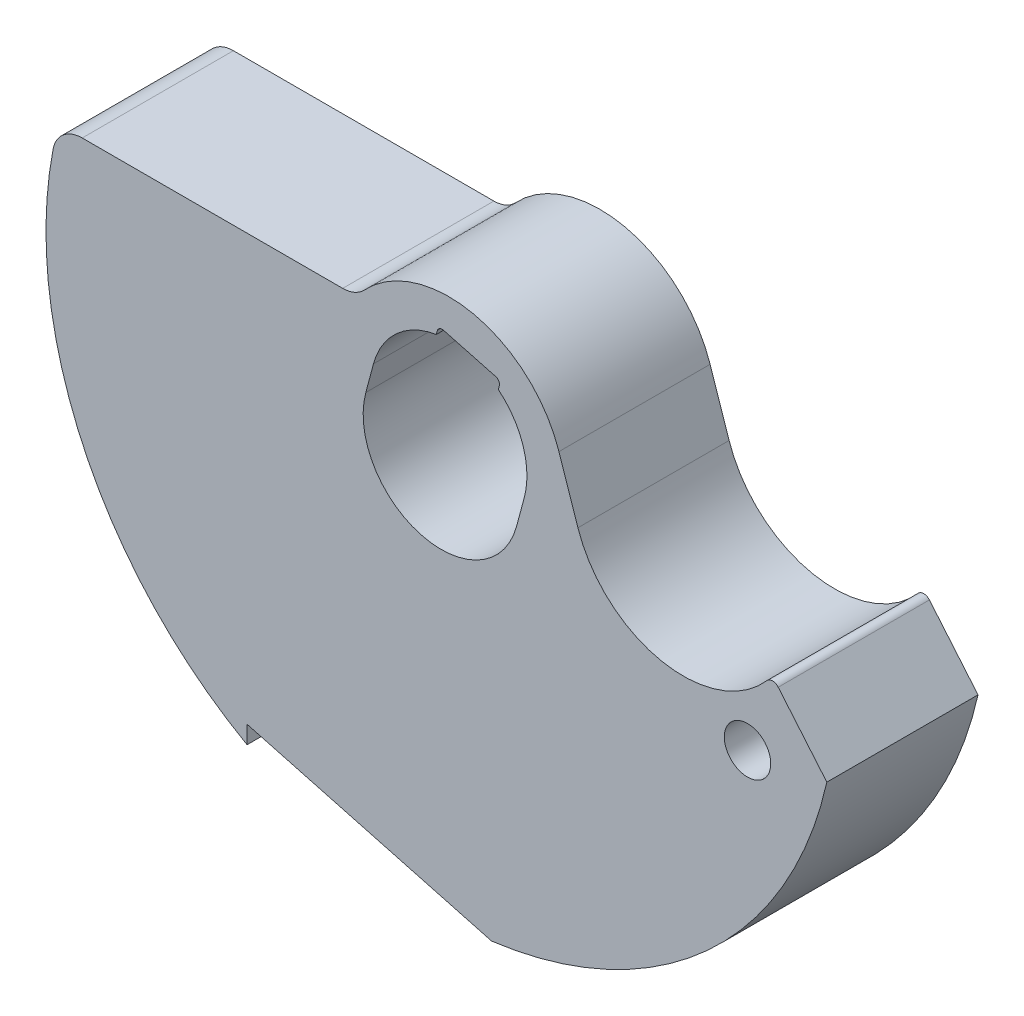
ISO-10303-21;
HEADER;
FILE_DESCRIPTION(('STEP AP214'),'2;1');
FILE_NAME('part.step','',(''),(''),'','','');
FILE_SCHEMA(('AUTOMOTIVE_DESIGN { 1 0 10303 214 1 1 1 1 }'));
ENDSEC;
DATA;
#1=APPLICATION_CONTEXT('core data for automotive mechanical design processes');
#2=APPLICATION_PROTOCOL_DEFINITION('international standard','automotive_design',2000,#1);
#3=PRODUCT_CONTEXT('',#1,'mechanical');
#4=PRODUCT('Part','Part','',(#3));
#5=PRODUCT_RELATED_PRODUCT_CATEGORY('part','',(#4));
#6=PRODUCT_DEFINITION_FORMATION('','',#4);
#7=PRODUCT_DEFINITION_CONTEXT('part definition',#1,'design');
#8=PRODUCT_DEFINITION('design','',#6,#7);
#9=PRODUCT_DEFINITION_SHAPE('','',#8);
#10=(LENGTH_UNIT() NAMED_UNIT(*) SI_UNIT(.MILLI.,.METRE.));
#11=(NAMED_UNIT(*) PLANE_ANGLE_UNIT() SI_UNIT($,.RADIAN.));
#12=(NAMED_UNIT(*) SI_UNIT($,.STERADIAN.) SOLID_ANGLE_UNIT());
#13=UNCERTAINTY_MEASURE_WITH_UNIT(LENGTH_MEASURE(1.E-05),#10,'distance_accuracy_value','');
#14=(GEOMETRIC_REPRESENTATION_CONTEXT(3) GLOBAL_UNCERTAINTY_ASSIGNED_CONTEXT((#13)) GLOBAL_UNIT_ASSIGNED_CONTEXT((#10,
#11,#12)) REPRESENTATION_CONTEXT('',''));
#15=CARTESIAN_POINT('',(0.,0.,0.));
#16=DIRECTION('',(0.,0.,1.));
#17=DIRECTION('',(1.,0.,0.));
#18=AXIS2_PLACEMENT_3D('',#15,#16,#17);
#19=CARTESIAN_POINT('',(-12.7084379808793,-41.0495620726679,-7.7724));
#20=DIRECTION('',(0.96592582628907,-0.258819045102514,0.));
#21=DIRECTION('',(0.258819045102514,0.96592582628907,0.));
#22=AXIS2_PLACEMENT_3D('',#19,#20,#21);
#23=PLANE('',#22);
#24=DIRECTION('',(0.258819045102514,0.96592582628907,0.));
#25=VECTOR('',#24,1.);
#26=CARTESIAN_POINT('',(-12.7084379808793,-41.0495620726679,0.));
#27=LINE('',#26,#25);
#28=CARTESIAN_POINT('',(-0.253578298371034,5.43260706359561,0.));
#29=VERTEX_POINT('',#28);
#30=CARTESIAN_POINT('',(-0.201054745135244,5.62862763286563,0.));
#31=VERTEX_POINT('',#30);
#32=EDGE_CURVE('E296',#29,#31,#27,.T.);
#33=ORIENTED_EDGE('',*,*,#32,.F.);
#34=DIRECTION('',(0.,0.,0.999999999999999));
#35=VECTOR('',#34,1.);
#36=CARTESIAN_POINT('',(-0.253578298371034,5.43260706359561,-7.7724));
#37=LINE('',#36,#35);
#38=CARTESIAN_POINT('',(-0.253578298371034,5.43260706359561,-7.7724));
#39=VERTEX_POINT('',#38);
#40=EDGE_CURVE('E12',#39,#29,#37,.T.);
#41=ORIENTED_EDGE('',*,*,#40,.F.);
#42=DIRECTION('',(0.258819045102514,0.96592582628907,0.));
#43=VECTOR('',#42,1.);
#44=CARTESIAN_POINT('',(-12.7084379808793,-41.0495620726679,-7.7724));
#45=LINE('',#44,#43);
#46=CARTESIAN_POINT('',(-0.201054745135244,5.62862763286563,-7.7724));
#47=VERTEX_POINT('',#46);
#48=EDGE_CURVE('E473',#39,#47,#45,.T.);
#49=ORIENTED_EDGE('',*,*,#48,.T.);
#50=DIRECTION('',(0.,0.,0.999999999999999));
#51=VECTOR('',#50,1.);
#52=CARTESIAN_POINT('',(-0.201054745135244,5.62862763286563,-7.7724));
#53=LINE('',#52,#51);
#54=EDGE_CURVE('E336',#47,#31,#53,.T.);
#55=ORIENTED_EDGE('',*,*,#54,.T.);
#56=EDGE_LOOP('',(#33,#41,#49,#55));
#57=FACE_BOUND('',#56,.T.);
#58=ADVANCED_FACE('F79',(#57),#23,.T.);
#59=CARTESIAN_POINT('',(0.394440224736232,1.47207095926455,-7.77239999999999));
#60=DIRECTION('',(0.,0.,0.999999999999999));
#61=DIRECTION('',(1.,0.,0.));
#62=AXIS2_PLACEMENT_3D('',#59,#60,#61);
#63=CYLINDRICAL_SURFACE('',#62,4.0132);
#64=CARTESIAN_POINT('',(0.394440224736232,1.47207095926454,0.));
#65=DIRECTION('',(0.,0.,0.999999999999999));
#66=DIRECTION('',(1.,0.,0.));
#67=AXIS2_PLACEMENT_3D('',#64,#65,#66);
#68=CIRCLE('',#67,4.0132);
#69=CARTESIAN_POINT('',(-3.48201330132707,2.51076355106995,0.));
#70=VERTEX_POINT('',#69);
#71=EDGE_CURVE('E320',#29,#70,#68,.T.);
#72=ORIENTED_EDGE('',*,*,#71,.T.);
#73=DIRECTION('',(0.,0.,0.999999999999999));
#74=VECTOR('',#73,1.);
#75=CARTESIAN_POINT('',(-3.48201330132707,2.51076355106995,-7.77239999999999));
#76=LINE('',#75,#74);
#77=CARTESIAN_POINT('',(-3.48201330132707,2.51076355106995,-7.77239999999999));
#78=VERTEX_POINT('',#77);
#79=EDGE_CURVE('E89',#78,#70,#76,.T.);
#80=ORIENTED_EDGE('',*,*,#79,.F.);
#81=CARTESIAN_POINT('',(0.394440224736232,1.47207095926455,-7.77239999999999));
#82=DIRECTION('',(0.,0.,0.999999999999999));
#83=DIRECTION('',(1.,0.,0.));
#84=AXIS2_PLACEMENT_3D('',#81,#82,#83);
#85=CIRCLE('',#84,4.0132);
#86=EDGE_CURVE('E255',#39,#78,#85,.T.);
#87=ORIENTED_EDGE('',*,*,#86,.F.);
#88=ORIENTED_EDGE('',*,*,#40,.T.);
#89=EDGE_LOOP('',(#72,#80,#87,#88));
#90=FACE_BOUND('',#89,.T.);
#91=ADVANCED_FACE('F386',(#90),#63,.F.);
#92=CARTESIAN_POINT('',(-14.9901479677394,-40.4381797243268,-7.7724));
#93=DIRECTION('',(0.96592582628907,-0.258819045102514,0.));
#94=DIRECTION('',(0.258819045102514,0.96592582628907,0.));
#95=AXIS2_PLACEMENT_3D('',#92,#93,#94);
#96=PLANE('',#95);
#97=DIRECTION('',(0.258819045102514,0.96592582628907,0.));
#98=VECTOR('',#97,1.);
#99=CARTESIAN_POINT('',(-14.9901479677394,-40.4381797243268,0.));
#100=LINE('',#99,#98);
#101=CARTESIAN_POINT('',(-3.8764535260633,1.03869259180541,0.));
#102=VERTEX_POINT('',#101);
#103=EDGE_CURVE('E239',#102,#70,#100,.T.);
#104=ORIENTED_EDGE('',*,*,#103,.F.);
#105=DIRECTION('',(0.,0.,0.999999999999999));
#106=VECTOR('',#105,1.);
#107=CARTESIAN_POINT('',(-3.8764535260633,1.03869259180542,-7.77239999999999));
#108=LINE('',#107,#106);
#109=CARTESIAN_POINT('',(-3.8764535260633,1.03869259180542,-7.77239999999999));
#110=VERTEX_POINT('',#109);
#111=EDGE_CURVE('E233',#110,#102,#108,.T.);
#112=ORIENTED_EDGE('',*,*,#111,.F.);
#113=DIRECTION('',(0.258819045102514,0.96592582628907,0.));
#114=VECTOR('',#113,1.);
#115=CARTESIAN_POINT('',(-14.9901479677394,-40.4381797243268,-7.7724));
#116=LINE('',#115,#114);
#117=EDGE_CURVE('E237',#110,#78,#116,.T.);
#118=ORIENTED_EDGE('',*,*,#117,.T.);
#119=ORIENTED_EDGE('',*,*,#79,.T.);
#120=EDGE_LOOP('',(#104,#112,#118,#119));
#121=FACE_BOUND('',#120,.T.);
#122=ADVANCED_FACE('F235',(#121),#96,.T.);
#123=CARTESIAN_POINT('',(0.,0.,-7.77239999999999));
#124=DIRECTION('',(0.,0.,0.999999999999999));
#125=DIRECTION('',(1.,0.,0.));
#126=AXIS2_PLACEMENT_3D('',#123,#124,#125);
#127=CYLINDRICAL_SURFACE('',#126,4.0132);
#128=CARTESIAN_POINT('',(0.,0.,0.));
#129=DIRECTION('',(0.,0.,0.999999999999999));
#130=DIRECTION('',(1.,0.,0.));
#131=AXIS2_PLACEMENT_3D('',#128,#129,#130);
#132=CIRCLE('',#131,4.0132);
#133=CARTESIAN_POINT('',(3.8764535260633,-1.0386925918054,0.));
#134=VERTEX_POINT('',#133);
#135=EDGE_CURVE('E317',#102,#134,#132,.T.);
#136=ORIENTED_EDGE('',*,*,#135,.T.);
#137=DIRECTION('',(0.,0.,0.999999999999999));
#138=VECTOR('',#137,1.);
#139=CARTESIAN_POINT('',(3.8764535260633,-1.03869259180541,-7.77239999999999));
#140=LINE('',#139,#138);
#141=CARTESIAN_POINT('',(3.8764535260633,-1.03869259180541,-7.77239999999999));
#142=VERTEX_POINT('',#141);
#143=EDGE_CURVE('E243',#142,#134,#140,.T.);
#144=ORIENTED_EDGE('',*,*,#143,.F.);
#145=CARTESIAN_POINT('',(0.,0.,-7.77239999999999));
#146=DIRECTION('',(0.,0.,0.999999999999999));
#147=DIRECTION('',(1.,0.,0.));
#148=AXIS2_PLACEMENT_3D('',#145,#146,#147);
#149=CIRCLE('',#148,4.0132);
#150=EDGE_CURVE('E246',#110,#142,#149,.T.);
#151=ORIENTED_EDGE('',*,*,#150,.F.);
#152=ORIENTED_EDGE('',*,*,#111,.T.);
#153=EDGE_LOOP('',(#136,#144,#151,#152));
#154=FACE_BOUND('',#153,.T.);
#155=ADVANCED_FACE('F247',(#154),#127,.F.);
#156=CARTESIAN_POINT('',(-7.23724091561279,-42.5155649079376,-7.7724));
#157=DIRECTION('',(-0.96592582628907,0.258819045102514,0.));
#158=DIRECTION('',(-0.258819045102514,-0.96592582628907,0.));
#159=AXIS2_PLACEMENT_3D('',#156,#157,#158);
#160=PLANE('',#159);
#161=DIRECTION('',(-0.258819045102514,-0.96592582628907,0.));
#162=VECTOR('',#161,1.);
#163=CARTESIAN_POINT('',(-7.23724091561279,-42.5155649079376,0.));
#164=LINE('',#163,#162);
#165=CARTESIAN_POINT('',(4.27089375079953,0.433378367459138,0.));
#166=VERTEX_POINT('',#165);
#167=EDGE_CURVE('E314',#166,#134,#164,.T.);
#168=ORIENTED_EDGE('',*,*,#167,.F.);
#169=DIRECTION('',(0.,0.,0.999999999999999));
#170=VECTOR('',#169,1.);
#171=CARTESIAN_POINT('',(4.27089375079953,0.433378367459138,-7.77239999999999));
#172=LINE('',#171,#170);
#173=CARTESIAN_POINT('',(4.27089375079953,0.433378367459138,-7.77239999999999));
#174=VERTEX_POINT('',#173);
#175=EDGE_CURVE('E325',#174,#166,#172,.T.);
#176=ORIENTED_EDGE('',*,*,#175,.F.);
#177=DIRECTION('',(-0.258819045102514,-0.96592582628907,0.));
#178=VECTOR('',#177,1.);
#179=CARTESIAN_POINT('',(-7.23724091561279,-42.5155649079376,-7.7724));
#180=LINE('',#179,#178);
#181=EDGE_CURVE('E251',#174,#142,#180,.T.);
#182=ORIENTED_EDGE('',*,*,#181,.T.);
#183=ORIENTED_EDGE('',*,*,#143,.T.);
#184=EDGE_LOOP('',(#168,#176,#182,#183));
#185=FACE_BOUND('',#184,.T.);
#186=ADVANCED_FACE('F493',(#185),#160,.T.);
#187=CARTESIAN_POINT('',(0.394440224736232,1.47207095926455,-7.77239999999999));
#188=DIRECTION('',(0.,0.,0.999999999999999));
#189=DIRECTION('',(1.,0.,0.));
#190=AXIS2_PLACEMENT_3D('',#187,#188,#189);
#191=CYLINDRICAL_SURFACE('',#190,4.0132);
#192=CARTESIAN_POINT('',(0.394440224736232,1.47207095926454,0.));
#193=DIRECTION('',(0.,0.,0.999999999999999));
#194=DIRECTION('',(1.,0.,0.));
#195=AXIS2_PLACEMENT_3D('',#192,#193,#194);
#196=CIRCLE('',#195,4.0132);
#197=CARTESIAN_POINT('',(2.93590878003548,4.57798657666712,0.));
#198=VERTEX_POINT('',#197);
#199=EDGE_CURVE('E311',#166,#198,#196,.T.);
#200=ORIENTED_EDGE('',*,*,#199,.T.);
#201=DIRECTION('',(0.,0.,0.999999999999999));
#202=VECTOR('',#201,1.);
#203=CARTESIAN_POINT('',(2.93590878003548,4.57798657666712,-7.7724));
#204=LINE('',#203,#202);
#205=CARTESIAN_POINT('',(2.93590878003548,4.57798657666712,-7.7724));
#206=VERTEX_POINT('',#205);
#207=EDGE_CURVE('E327',#206,#198,#204,.T.);
#208=ORIENTED_EDGE('',*,*,#207,.F.);
#209=CARTESIAN_POINT('',(0.394440224736232,1.47207095926455,-7.77239999999999));
#210=DIRECTION('',(0.,0.,0.999999999999999));
#211=DIRECTION('',(1.,0.,0.));
#212=AXIS2_PLACEMENT_3D('',#209,#210,#211);
#213=CIRCLE('',#212,4.0132);
#214=EDGE_CURVE('E489',#174,#206,#213,.T.);
#215=ORIENTED_EDGE('',*,*,#214,.F.);
#216=ORIENTED_EDGE('',*,*,#175,.T.);
#217=EDGE_LOOP('',(#200,#208,#215,#216));
#218=FACE_BOUND('',#217,.T.);
#219=ADVANCED_FACE('F499',(#218),#191,.F.);
#220=CARTESIAN_POINT('',(-9.51895090247281,-41.9041825595964,-7.7724));
#221=DIRECTION('',(0.96592582628907,-0.258819045102513,0.));
#222=DIRECTION('',(0.258819045102513,0.96592582628907,0.));
#223=AXIS2_PLACEMENT_3D('',#220,#221,#222);
#224=PLANE('',#223);
#225=DIRECTION('',(0.258819045102513,0.96592582628907,0.));
#226=VECTOR('',#225,1.);
#227=CARTESIAN_POINT('',(-9.51895090247281,-41.9041825595964,0.));
#228=LINE('',#227,#226);
#229=CARTESIAN_POINT('',(2.98843233327127,4.77400714593713,0.));
#230=VERTEX_POINT('',#229);
#231=EDGE_CURVE('E308',#198,#230,#228,.T.);
#232=ORIENTED_EDGE('',*,*,#231,.T.);
#233=DIRECTION('',(0.,0.,0.999999999999999));
#234=VECTOR('',#233,1.);
#235=CARTESIAN_POINT('',(2.98843233327127,4.77400714593714,-7.7724));
#236=LINE('',#235,#234);
#237=CARTESIAN_POINT('',(2.98843233327127,4.77400714593714,-7.7724));
#238=VERTEX_POINT('',#237);
#239=EDGE_CURVE('E330',#238,#230,#236,.T.);
#240=ORIENTED_EDGE('',*,*,#239,.F.);
#241=DIRECTION('',(0.258819045102513,0.96592582628907,0.));
#242=VECTOR('',#241,1.);
#243=CARTESIAN_POINT('',(-9.51895090247281,-41.9041825595964,-7.7724));
#244=LINE('',#243,#242);
#245=EDGE_CURVE('E487',#206,#238,#244,.T.);
#246=ORIENTED_EDGE('',*,*,#245,.F.);
#247=ORIENTED_EDGE('',*,*,#207,.T.);
#248=EDGE_LOOP('',(#232,#240,#246,#247));
#249=FACE_BOUND('',#248,.T.);
#250=ADVANCED_FACE('F502',(#249),#224,.F.);
#251=CARTESIAN_POINT('',(2.74308717339385,4.83974718339318,-7.7724));
#252=DIRECTION('',(0.,0.,0.999999999999999));
#253=DIRECTION('',(1.,0.,0.));
#254=AXIS2_PLACEMENT_3D('',#251,#252,#253);
#255=CYLINDRICAL_SURFACE('',#254,0.254);
#256=CARTESIAN_POINT('',(2.74308717339385,4.83974718339318,0.));
#257=DIRECTION('',(0.,0.,0.999999999999999));
#258=DIRECTION('',(1.,0.,0.));
#259=AXIS2_PLACEMENT_3D('',#256,#257,#258);
#260=CIRCLE('',#259,0.254);
#261=CARTESIAN_POINT('',(2.80882721084989,5.08509234327061,0.));
#262=VERTEX_POINT('',#261);
#263=EDGE_CURVE('E305',#262,#230,#260,.F.);
#264=ORIENTED_EDGE('',*,*,#263,.F.);
#265=DIRECTION('',(0.,0.,0.999999999999999));
#266=VECTOR('',#265,1.);
#267=CARTESIAN_POINT('',(2.80882721084989,5.08509234327061,-7.7724));
#268=LINE('',#267,#266);
#269=CARTESIAN_POINT('',(2.80882721084989,5.08509234327061,-7.7724));
#270=VERTEX_POINT('',#269);
#271=EDGE_CURVE('E332',#270,#262,#268,.T.);
#272=ORIENTED_EDGE('',*,*,#271,.F.);
#273=CARTESIAN_POINT('',(2.74308717339385,4.83974718339318,-7.7724));
#274=DIRECTION('',(0.,0.,0.999999999999999));
#275=DIRECTION('',(1.,0.,0.));
#276=AXIS2_PLACEMENT_3D('',#273,#274,#275);
#277=CIRCLE('',#276,0.254);
#278=EDGE_CURVE('E484',#270,#238,#277,.F.);
#279=ORIENTED_EDGE('',*,*,#278,.T.);
#280=ORIENTED_EDGE('',*,*,#239,.T.);
#281=EDGE_LOOP('',(#264,#272,#279,#280));
#282=FACE_BOUND('',#281,.T.);
#283=ADVANCED_FACE('F505',(#282),#255,.F.);
#284=CARTESIAN_POINT('',(12.3252883505552,2.53516426608447,-7.77239999999999));
#285=DIRECTION('',(0.258819045102514,0.96592582628907,0.));
#286=DIRECTION('',(-0.96592582628907,0.258819045102514,0.));
#287=AXIS2_PLACEMENT_3D('',#284,#285,#286);
#288=PLANE('',#287);
#289=DIRECTION('',(-0.96592582628907,0.258819045102514,0.));
#290=VECTOR('',#289,1.);
#291=CARTESIAN_POINT('',(12.3252883505552,2.53516426608447,0.));
#292=LINE('',#291,#290);
#293=CARTESIAN_POINT('',(0.110030452198227,5.80823275528702,0.));
#294=VERTEX_POINT('',#293);
#295=EDGE_CURVE('E302',#262,#294,#292,.T.);
#296=ORIENTED_EDGE('',*,*,#295,.T.);
#297=DIRECTION('',(0.,0.,0.999999999999999));
#298=VECTOR('',#297,1.);
#299=CARTESIAN_POINT('',(0.110030452198227,5.80823275528703,-7.7724));
#300=LINE('',#299,#298);
#301=CARTESIAN_POINT('',(0.110030452198227,5.80823275528703,-7.7724));
#302=VERTEX_POINT('',#301);
#303=EDGE_CURVE('E334',#302,#294,#300,.T.);
#304=ORIENTED_EDGE('',*,*,#303,.F.);
#305=DIRECTION('',(-0.96592582628907,0.258819045102514,0.));
#306=VECTOR('',#305,1.);
#307=CARTESIAN_POINT('',(12.3252883505552,2.53516426608447,-7.77239999999999));
#308=LINE('',#307,#306);
#309=EDGE_CURVE('E482',#270,#302,#308,.T.);
#310=ORIENTED_EDGE('',*,*,#309,.F.);
#311=ORIENTED_EDGE('',*,*,#271,.T.);
#312=EDGE_LOOP('',(#296,#304,#310,#311));
#313=FACE_BOUND('',#312,.T.);
#314=ADVANCED_FACE('F510',(#313),#288,.F.);
#315=CARTESIAN_POINT('',(-5.06526245222853,6.604,-7.77239999999999));
#316=DIRECTION('',(0.,0.,0.999999999999999));
#317=DIRECTION('',(1.,0.,0.));
#318=AXIS2_PLACEMENT_3D('',#315,#316,#317);
#319=CYLINDRICAL_SURFACE('',#318,1.524);
#320=CARTESIAN_POINT('',(-5.06526245222852,6.604,0.));
#321=DIRECTION('',(0.,0.,0.999999999999999));
#322=DIRECTION('',(1.,0.,0.));
#323=AXIS2_PLACEMENT_3D('',#320,#321,#322);
#324=CIRCLE('',#323,1.524);
#325=CARTESIAN_POINT('',(-5.06526245222852,5.07999999999999,0.));
#326=VERTEX_POINT('',#325);
#327=CARTESIAN_POINT('',(-3.954814450134,5.56021782222329,0.));
#328=VERTEX_POINT('',#327);
#329=EDGE_CURVE('E260',#326,#328,#324,.T.);
#330=ORIENTED_EDGE('',*,*,#329,.T.);
#331=DIRECTION('',(0.,0.,0.999999999999999));
#332=VECTOR('',#331,1.);
#333=CARTESIAN_POINT('',(-3.954814450134,5.5602178222233,-7.77239999999999));
#334=LINE('',#333,#332);
#335=CARTESIAN_POINT('',(-3.954814450134,5.5602178222233,-7.77239999999999));
#336=VERTEX_POINT('',#335);
#337=EDGE_CURVE('E338',#336,#328,#334,.T.);
#338=ORIENTED_EDGE('',*,*,#337,.F.);
#339=CARTESIAN_POINT('',(-5.06526245222853,6.604,-7.77239999999999));
#340=DIRECTION('',(0.,0.,0.999999999999999));
#341=DIRECTION('',(1.,0.,0.));
#342=AXIS2_PLACEMENT_3D('',#339,#340,#341);
#343=CIRCLE('',#342,1.524);
#344=CARTESIAN_POINT('',(-5.06526245222853,5.08,-7.77239999999999));
#345=VERTEX_POINT('',#344);
#346=EDGE_CURVE('E321',#345,#336,#343,.T.);
#347=ORIENTED_EDGE('',*,*,#346,.F.);
#348=DIRECTION('',(0.,0.,0.999999999999999));
#349=VECTOR('',#348,1.);
#350=CARTESIAN_POINT('',(-5.06526245222853,5.08,-7.77239999999999));
#351=LINE('',#350,#349);
#352=EDGE_CURVE('E83',#345,#326,#351,.T.);
#353=ORIENTED_EDGE('',*,*,#352,.T.);
#354=EDGE_LOOP('',(#330,#338,#347,#353));
#355=FACE_BOUND('',#354,.T.);
#356=ADVANCED_FACE('F81',(#355),#319,.F.);
#357=CARTESIAN_POINT('',(0.394440224736232,1.47207095926455,-7.77239999999999));
#358=DIRECTION('',(0.,0.,0.999999999999999));
#359=DIRECTION('',(1.,0.,0.));
#360=AXIS2_PLACEMENT_3D('',#357,#358,#359);
#361=CYLINDRICAL_SURFACE('',#360,5.969);
#362=CARTESIAN_POINT('',(0.394440224736232,1.47207095926454,0.));
#363=DIRECTION('',(0.,0.,0.999999999999999));
#364=DIRECTION('',(1.,0.,0.));
#365=AXIS2_PLACEMENT_3D('',#362,#363,#364);
#366=CIRCLE('',#365,5.969);
#367=CARTESIAN_POINT('',(6.05309678714434,3.37169379254373,0.));
#368=VERTEX_POINT('',#367);
#369=EDGE_CURVE('E290',#368,#328,#366,.T.);
#370=ORIENTED_EDGE('',*,*,#369,.F.);
#371=DIRECTION('',(0.,0.,0.999999999999999));
#372=VECTOR('',#371,1.);
#373=CARTESIAN_POINT('',(6.05309678714434,3.37169379254373,-7.7724));
#374=LINE('',#373,#372);
#375=CARTESIAN_POINT('',(6.05309678714434,3.37169379254373,-7.7724));
#376=VERTEX_POINT('',#375);
#377=EDGE_CURVE('E340',#376,#368,#374,.T.);
#378=ORIENTED_EDGE('',*,*,#377,.F.);
#379=CARTESIAN_POINT('',(0.394440224736232,1.47207095926455,-7.77239999999999));
#380=DIRECTION('',(0.,0.,0.999999999999999));
#381=DIRECTION('',(1.,0.,0.));
#382=AXIS2_PLACEMENT_3D('',#379,#380,#381);
#383=CIRCLE('',#382,5.969);
#384=EDGE_CURVE('E468',#376,#336,#383,.T.);
#385=ORIENTED_EDGE('',*,*,#384,.T.);
#386=ORIENTED_EDGE('',*,*,#337,.T.);
#387=EDGE_LOOP('',(#370,#378,#385,#386));
#388=FACE_BOUND('',#387,.T.);
#389=ADVANCED_FACE('F394',(#388),#361,.T.);
#390=CARTESIAN_POINT('',(19.8242128602196,-37.6501422126979,-7.77239999999999));
#391=DIRECTION('',(-0.948007465640494,-0.318248087331075,0.));
#392=DIRECTION('',(0.318248087331075,-0.948007465640494,0.));
#393=AXIS2_PLACEMENT_3D('',#390,#391,#392);
#394=PLANE('',#393);
#395=DIRECTION('',(0.318248087331075,-0.948007465640494,0.));
#396=VECTOR('',#395,1.);
#397=CARTESIAN_POINT('',(19.8242128602196,-37.6501422126979,0.));
#398=LINE('',#397,#396);
#399=CARTESIAN_POINT('',(7.02813733386457,0.467212180902898,0.));
#400=VERTEX_POINT('',#399);
#401=EDGE_CURVE('E288',#368,#400,#398,.T.);
#402=ORIENTED_EDGE('',*,*,#401,.T.);
#403=DIRECTION('',(0.,0.,0.999999999999999));
#404=VECTOR('',#403,1.);
#405=CARTESIAN_POINT('',(7.02813733386457,0.467212180902905,-7.7724));
#406=LINE('',#405,#404);
#407=CARTESIAN_POINT('',(7.02813733386457,0.467212180902905,-7.7724));
#408=VERTEX_POINT('',#407);
#409=EDGE_CURVE('E342',#408,#400,#406,.T.);
#410=ORIENTED_EDGE('',*,*,#409,.F.);
#411=DIRECTION('',(0.318248087331075,-0.948007465640494,0.));
#412=VECTOR('',#411,1.);
#413=CARTESIAN_POINT('',(19.8242128602196,-37.6501422126979,-7.77239999999999));
#414=LINE('',#413,#412);
#415=EDGE_CURVE('E465',#376,#408,#414,.T.);
#416=ORIENTED_EDGE('',*,*,#415,.F.);
#417=ORIENTED_EDGE('',*,*,#377,.T.);
#418=EDGE_LOOP('',(#402,#410,#416,#417));
#419=FACE_BOUND('',#418,.T.);
#420=ADVANCED_FACE('F397',(#419),#394,.F.);
#421=CARTESIAN_POINT('',(12.446,2.286,-7.77239999999999));
#422=DIRECTION('',(0.,0.,0.999999999999999));
#423=DIRECTION('',(1.,0.,0.));
#424=AXIS2_PLACEMENT_3D('',#421,#422,#423);
#425=CYLINDRICAL_SURFACE('',#424,5.715);
#426=CARTESIAN_POINT('',(12.446,2.28599999999999,0.));
#427=DIRECTION('',(0.,0.,0.999999999999999));
#428=DIRECTION('',(1.,0.,0.));
#429=AXIS2_PLACEMENT_3D('',#426,#427,#428);
#430=CIRCLE('',#429,5.715);
#431=CARTESIAN_POINT('',(16.7471737728406,-1.47712757899966,0.));
#432=VERTEX_POINT('',#431);
#433=EDGE_CURVE('E286',#400,#432,#430,.T.);
#434=ORIENTED_EDGE('',*,*,#433,.T.);
#435=DIRECTION('',(0.,0.,0.999999999999999));
#436=VECTOR('',#435,1.);
#437=CARTESIAN_POINT('',(16.7471737728406,-1.47712757899966,-7.77239999999999));
#438=LINE('',#437,#436);
#439=CARTESIAN_POINT('',(16.7471737728406,-1.47712757899966,-7.77239999999999));
#440=VERTEX_POINT('',#439);
#441=EDGE_CURVE('E345',#440,#432,#438,.T.);
#442=ORIENTED_EDGE('',*,*,#441,.F.);
#443=CARTESIAN_POINT('',(12.446,2.286,-7.77239999999999));
#444=DIRECTION('',(0.,0.,0.999999999999999));
#445=DIRECTION('',(1.,0.,0.));
#446=AXIS2_PLACEMENT_3D('',#443,#444,#445);
#447=CIRCLE('',#446,5.715);
#448=EDGE_CURVE('E463',#408,#440,#447,.T.);
#449=ORIENTED_EDGE('',*,*,#448,.F.);
#450=ORIENTED_EDGE('',*,*,#409,.T.);
#451=EDGE_LOOP('',(#434,#442,#449,#450));
#452=FACE_BOUND('',#451,.T.);
#453=ADVANCED_FACE('F401',(#452),#425,.F.);
#454=CARTESIAN_POINT('',(17.03391869103,-1.72800275093297,-7.77239999999999));
#455=DIRECTION('',(0.,0.,0.999999999999999));
#456=DIRECTION('',(1.,0.,0.));
#457=AXIS2_PLACEMENT_3D('',#454,#455,#456);
#458=CYLINDRICAL_SURFACE('',#457,0.381);
#459=CARTESIAN_POINT('',(17.03391869103,-1.72800275093296,0.));
#460=DIRECTION('',(0.,0.,0.999999999999999));
#461=DIRECTION('',(1.,0.,0.));
#462=AXIS2_PLACEMENT_3D('',#459,#460,#461);
#463=CIRCLE('',#462,0.381);
#464=CARTESIAN_POINT('',(17.3257816238584,-1.48310067164239,0.));
#465=VERTEX_POINT('',#464);
#466=EDGE_CURVE('E284',#432,#465,#463,.F.);
#467=ORIENTED_EDGE('',*,*,#466,.T.);
#468=DIRECTION('',(0.,0.,0.999999999999999));
#469=VECTOR('',#468,1.);
#470=CARTESIAN_POINT('',(17.3257816238584,-1.4831006716424,-7.77239999999999));
#471=LINE('',#470,#469);
#472=CARTESIAN_POINT('',(17.3257816238584,-1.4831006716424,-7.77239999999999));
#473=VERTEX_POINT('',#472);
#474=EDGE_CURVE('E348',#473,#465,#471,.T.);
#475=ORIENTED_EDGE('',*,*,#474,.F.);
#476=CARTESIAN_POINT('',(17.03391869103,-1.72800275093297,-7.77239999999999));
#477=DIRECTION('',(0.,0.,0.999999999999999));
#478=DIRECTION('',(1.,0.,0.));
#479=AXIS2_PLACEMENT_3D('',#476,#477,#478);
#480=CIRCLE('',#479,0.381);
#481=EDGE_CURVE('E458',#440,#473,#480,.F.);
#482=ORIENTED_EDGE('',*,*,#481,.F.);
#483=ORIENTED_EDGE('',*,*,#441,.T.);
#484=EDGE_LOOP('',(#467,#475,#482,#483));
#485=FACE_BOUND('',#484,.T.);
#486=ADVANCED_FACE('F405',(#485),#458,.T.);
#487=CARTESIAN_POINT('',(31.1915078296979,-18.0076296913792,-7.7724));
#488=DIRECTION('',(-0.766044443118974,-0.642787609686544,0.));
#489=DIRECTION('',(0.642787609686544,-0.766044443118974,0.));
#490=AXIS2_PLACEMENT_3D('',#487,#488,#489);
#491=PLANE('',#490);
#492=DIRECTION('',(0.642787609686544,-0.766044443118974,0.));
#493=VECTOR('',#492,1.);
#494=CARTESIAN_POINT('',(31.1915078296979,-18.0076296913792,0.));
#495=LINE('',#494,#493);
#496=CARTESIAN_POINT('',(19.8243301547101,-4.46075485955592,0.));
#497=VERTEX_POINT('',#496);
#498=EDGE_CURVE('E281',#465,#497,#495,.T.);
#499=ORIENTED_EDGE('',*,*,#498,.T.);
#500=DIRECTION('',(0.,0.,0.999999999999999));
#501=VECTOR('',#500,1.);
#502=CARTESIAN_POINT('',(19.8243301547101,-4.46075485955592,-7.77239999999999));
#503=LINE('',#502,#501);
#504=CARTESIAN_POINT('',(19.8243301547101,-4.46075485955592,-7.77239999999999));
#505=VERTEX_POINT('',#504);
#506=EDGE_CURVE('E351',#505,#497,#503,.T.);
#507=ORIENTED_EDGE('',*,*,#506,.F.);
#508=DIRECTION('',(0.642787609686544,-0.766044443118974,0.));
#509=VECTOR('',#508,1.);
#510=CARTESIAN_POINT('',(31.1915078296979,-18.0076296913792,-7.7724));
#511=LINE('',#510,#509);
#512=EDGE_CURVE('E456',#473,#505,#511,.T.);
#513=ORIENTED_EDGE('',*,*,#512,.F.);
#514=ORIENTED_EDGE('',*,*,#474,.T.);
#515=EDGE_LOOP('',(#499,#507,#513,#514));
#516=FACE_BOUND('',#515,.T.);
#517=ADVANCED_FACE('F409',(#516),#491,.F.);
#518=CARTESIAN_POINT('',(0.,0.,-7.77239999999999));
#519=DIRECTION('',(0.,0.,0.999999999999999));
#520=DIRECTION('',(1.,0.,0.));
#521=AXIS2_PLACEMENT_3D('',#518,#519,#520);
#522=CYLINDRICAL_SURFACE('',#521,20.32);
#523=CARTESIAN_POINT('',(0.,0.,0.));
#524=DIRECTION('',(0.,0.,0.999999999999999));
#525=DIRECTION('',(1.,0.,0.));
#526=AXIS2_PLACEMENT_3D('',#523,#524,#525);
#527=CIRCLE('',#526,20.32);
#528=CARTESIAN_POINT('',(2.59308441542168,-20.1538659620058,0.));
#529=VERTEX_POINT('',#528);
#530=EDGE_CURVE('E278',#529,#497,#527,.T.);
#531=ORIENTED_EDGE('',*,*,#530,.F.);
#532=DIRECTION('',(0.,0.,0.999999999999999));
#533=VECTOR('',#532,1.);
#534=CARTESIAN_POINT('',(2.59308441542168,-20.1538659620058,-7.77239999999999));
#535=LINE('',#534,#533);
#536=CARTESIAN_POINT('',(2.59308441542168,-20.1538659620058,-7.77239999999999));
#537=VERTEX_POINT('',#536);
#538=EDGE_CURVE('E353',#537,#529,#535,.T.);
#539=ORIENTED_EDGE('',*,*,#538,.F.);
#540=CARTESIAN_POINT('',(0.,0.,-7.77239999999999));
#541=DIRECTION('',(0.,0.,0.999999999999999));
#542=DIRECTION('',(1.,0.,0.));
#543=AXIS2_PLACEMENT_3D('',#540,#541,#542);
#544=CIRCLE('',#543,20.32);
#545=EDGE_CURVE('E453',#537,#505,#544,.T.);
#546=ORIENTED_EDGE('',*,*,#545,.T.);
#547=ORIENTED_EDGE('',*,*,#506,.T.);
#548=EDGE_LOOP('',(#531,#539,#546,#547));
#549=FACE_BOUND('',#548,.T.);
#550=ADVANCED_FACE('F413',(#549),#522,.T.);
#551=CARTESIAN_POINT('',(6.00109674728428,-21.0670401141237,-7.77239999999999));
#552=DIRECTION('',(-0.258819045102514,-0.96592582628907,0.));
#553=DIRECTION('',(0.96592582628907,-0.258819045102514,0.));
#554=AXIS2_PLACEMENT_3D('',#551,#552,#553);
#555=PLANE('',#554);
#556=DIRECTION('',(0.96592582628907,-0.258819045102514,0.));
#557=VECTOR('',#556,1.);
#558=CARTESIAN_POINT('',(6.00109674728428,-21.0670401141237,0.));
#559=LINE('',#558,#557);
#560=CARTESIAN_POINT('',(-9.9822,-16.784328658302,0.));
#561=VERTEX_POINT('',#560);
#562=EDGE_CURVE('E275',#561,#529,#559,.T.);
#563=ORIENTED_EDGE('',*,*,#562,.F.);
#564=DIRECTION('',(0.,0.,0.999999999999999));
#565=VECTOR('',#564,1.);
#566=CARTESIAN_POINT('',(-9.9822,-16.784328658302,-7.77239999999999));
#567=LINE('',#566,#565);
#568=CARTESIAN_POINT('',(-9.9822,-16.784328658302,-7.77239999999999));
#569=VERTEX_POINT('',#568);
#570=EDGE_CURVE('E355',#569,#561,#567,.T.);
#571=ORIENTED_EDGE('',*,*,#570,.F.);
#572=DIRECTION('',(0.96592582628907,-0.258819045102514,0.));
#573=VECTOR('',#572,1.);
#574=CARTESIAN_POINT('',(6.00109674728428,-21.0670401141237,-7.77239999999999));
#575=LINE('',#574,#573);
#576=EDGE_CURVE('E446',#569,#537,#575,.T.);
#577=ORIENTED_EDGE('',*,*,#576,.T.);
#578=ORIENTED_EDGE('',*,*,#538,.T.);
#579=EDGE_LOOP('',(#563,#571,#577,#578));
#580=FACE_BOUND('',#579,.T.);
#581=ADVANCED_FACE('F417',(#580),#555,.T.);
#582=CARTESIAN_POINT('',(-9.9822,-44.3883705993265,-7.7724));
#583=DIRECTION('',(-1.,0.,0.));
#584=DIRECTION('',(0.,0.,0.999999999999999));
#585=AXIS2_PLACEMENT_3D('',#582,#583,#584);
#586=PLANE('',#585);
#587=DIRECTION('',(0.,-1.,0.));
#588=VECTOR('',#587,1.);
#589=CARTESIAN_POINT('',(-9.9822,-44.3883705993265,0.));
#590=LINE('',#589,#588);
#591=CARTESIAN_POINT('',(-9.9822,-17.699098371386,0.));
#592=VERTEX_POINT('',#591);
#593=EDGE_CURVE('E272',#561,#592,#590,.T.);
#594=ORIENTED_EDGE('',*,*,#593,.T.);
#595=DIRECTION('',(0.,0.,0.999999999999999));
#596=VECTOR('',#595,1.);
#597=CARTESIAN_POINT('',(-9.9822,-17.699098371386,-7.77239999999999));
#598=LINE('',#597,#596);
#599=CARTESIAN_POINT('',(-9.9822,-17.699098371386,-7.77239999999999));
#600=VERTEX_POINT('',#599);
#601=EDGE_CURVE('E357',#600,#592,#598,.T.);
#602=ORIENTED_EDGE('',*,*,#601,.F.);
#603=DIRECTION('',(0.,-1.,0.));
#604=VECTOR('',#603,1.);
#605=CARTESIAN_POINT('',(-9.9822,-44.3883705993265,-7.7724));
#606=LINE('',#605,#604);
#607=EDGE_CURVE('E443',#569,#600,#606,.T.);
#608=ORIENTED_EDGE('',*,*,#607,.F.);
#609=ORIENTED_EDGE('',*,*,#570,.T.);
#610=EDGE_LOOP('',(#594,#602,#608,#609));
#611=FACE_BOUND('',#610,.T.);
#612=ADVANCED_FACE('F421',(#611),#586,.F.);
#613=CARTESIAN_POINT('',(0.,0.,-7.77239999999999));
#614=DIRECTION('',(0.,0.,0.999999999999999));
#615=DIRECTION('',(1.,0.,0.));
#616=AXIS2_PLACEMENT_3D('',#613,#614,#615);
#617=CYLINDRICAL_SURFACE('',#616,20.32);
#618=CARTESIAN_POINT('',(0.,0.,0.));
#619=DIRECTION('',(0.,0.,0.999999999999999));
#620=DIRECTION('',(1.,0.,0.));
#621=AXIS2_PLACEMENT_3D('',#618,#619,#620);
#622=CIRCLE('',#621,20.32);
#623=CARTESIAN_POINT('',(-19.953034117382,3.84432432432432,0.));
#624=VERTEX_POINT('',#623);
#625=EDGE_CURVE('E269',#624,#592,#622,.T.);
#626=ORIENTED_EDGE('',*,*,#625,.F.);
#627=DIRECTION('',(0.,0.,0.999999999999999));
#628=VECTOR('',#627,1.);
#629=CARTESIAN_POINT('',(-19.953034117382,3.84432432432432,-7.7724));
#630=LINE('',#629,#628);
#631=CARTESIAN_POINT('',(-19.953034117382,3.84432432432432,-7.7724));
#632=VERTEX_POINT('',#631);
#633=EDGE_CURVE('E359',#632,#624,#630,.T.);
#634=ORIENTED_EDGE('',*,*,#633,.F.);
#635=CARTESIAN_POINT('',(0.,0.,-7.77239999999999));
#636=DIRECTION('',(0.,0.,0.999999999999999));
#637=DIRECTION('',(1.,0.,0.));
#638=AXIS2_PLACEMENT_3D('',#635,#636,#637);
#639=CIRCLE('',#638,20.32);
#640=EDGE_CURVE('E441',#632,#600,#639,.T.);
#641=ORIENTED_EDGE('',*,*,#640,.T.);
#642=ORIENTED_EDGE('',*,*,#601,.T.);
#643=EDGE_LOOP('',(#626,#634,#641,#642));
#644=FACE_BOUND('',#643,.T.);
#645=ADVANCED_FACE('F425',(#644),#617,.T.);
#646=CARTESIAN_POINT('',(-18.4565565585783,3.556,-7.7724));
#647=DIRECTION('',(0.,0.,0.999999999999999));
#648=DIRECTION('',(1.,0.,0.));
#649=AXIS2_PLACEMENT_3D('',#646,#647,#648);
#650=CYLINDRICAL_SURFACE('',#649,1.524);
#651=CARTESIAN_POINT('',(-18.4565565585783,3.55599999999999,0.));
#652=DIRECTION('',(0.,0.,0.999999999999999));
#653=DIRECTION('',(1.,0.,0.));
#654=AXIS2_PLACEMENT_3D('',#651,#652,#653);
#655=CIRCLE('',#654,1.524);
#656=CARTESIAN_POINT('',(-18.4565565585783,5.07999999999999,0.));
#657=VERTEX_POINT('',#656);
#658=EDGE_CURVE('E266',#657,#624,#655,.T.);
#659=ORIENTED_EDGE('',*,*,#658,.F.);
#660=DIRECTION('',(0.,0.,0.999999999999999));
#661=VECTOR('',#660,1.);
#662=CARTESIAN_POINT('',(-18.4565565585783,5.08,-7.7724));
#663=LINE('',#662,#661);
#664=CARTESIAN_POINT('',(-18.4565565585783,5.08,-7.7724));
#665=VERTEX_POINT('',#664);
#666=EDGE_CURVE('E360',#665,#657,#663,.T.);
#667=ORIENTED_EDGE('',*,*,#666,.F.);
#668=CARTESIAN_POINT('',(-18.4565565585783,3.556,-7.7724));
#669=DIRECTION('',(0.,0.,0.999999999999999));
#670=DIRECTION('',(1.,0.,0.));
#671=AXIS2_PLACEMENT_3D('',#668,#669,#670);
#672=CIRCLE('',#671,1.524);
#673=EDGE_CURVE('E682',#665,#632,#672,.T.);
#674=ORIENTED_EDGE('',*,*,#673,.T.);
#675=ORIENTED_EDGE('',*,*,#633,.T.);
#676=EDGE_LOOP('',(#659,#667,#674,#675));
#677=FACE_BOUND('',#676,.T.);
#678=ADVANCED_FACE('F381',(#677),#650,.T.);
#679=CARTESIAN_POINT('',(15.748,-5.07999999999999,-7.7724));
#680=DIRECTION('',(0.,0.,0.999999999999999));
#681=DIRECTION('',(1.,0.,0.));
#682=AXIS2_PLACEMENT_3D('',#679,#680,#681);
#683=CYLINDRICAL_SURFACE('',#682,1.1938);
#684=CARTESIAN_POINT('',(15.748,-5.07999999999999,-7.7724));
#685=DIRECTION('',(0.,0.,0.999999999999999));
#686=DIRECTION('',(1.,0.,0.));
#687=AXIS2_PLACEMENT_3D('',#684,#685,#686);
#688=CIRCLE('',#687,1.1938);
#689=CARTESIAN_POINT('',(16.9418,-5.07999999999999,-7.7724));
#690=VERTEX_POINT('',#689);
#691=EDGE_CURVE('E470',#690,#690,#688,.T.);
#692=ORIENTED_EDGE('',*,*,#691,.F.);
#693=EDGE_LOOP('',(#692));
#694=FACE_BOUND('',#693,.T.);
#695=CARTESIAN_POINT('',(15.748,-5.07999999999999,0.));
#696=DIRECTION('',(0.,0.,0.999999999999999));
#697=DIRECTION('',(1.,0.,0.));
#698=AXIS2_PLACEMENT_3D('',#695,#696,#697);
#699=CIRCLE('',#698,1.1938);
#700=CARTESIAN_POINT('',(16.9418,-5.07999999999999,0.));
#701=VERTEX_POINT('',#700);
#702=EDGE_CURVE('E293',#701,#701,#699,.T.);
#703=ORIENTED_EDGE('',*,*,#702,.T.);
#704=EDGE_LOOP('',(#703));
#705=FACE_BOUND('',#704,.T.);
#706=ADVANCED_FACE('F374',(#694,#705),#683,.F.);
#707=CARTESIAN_POINT('',(-0.247834922644956,5.08,-7.77239999999999));
#708=DIRECTION('',(0.,1.,0.));
#709=DIRECTION('',(-1.,0.,0.));
#710=AXIS2_PLACEMENT_3D('',#707,#708,#709);
#711=PLANE('',#710);
#712=DIRECTION('',(-1.,0.,0.));
#713=VECTOR('',#712,1.);
#714=CARTESIAN_POINT('',(-0.247834922644956,5.07999999999999,0.));
#715=LINE('',#714,#713);
#716=EDGE_CURVE('E263',#326,#657,#715,.T.);
#717=ORIENTED_EDGE('',*,*,#716,.F.);
#718=ORIENTED_EDGE('',*,*,#352,.F.);
#719=DIRECTION('',(-1.,0.,0.));
#720=VECTOR('',#719,1.);
#721=CARTESIAN_POINT('',(-0.247834922644956,5.08,-7.77239999999999));
#722=LINE('',#721,#720);
#723=EDGE_CURVE('E680',#345,#665,#722,.T.);
#724=ORIENTED_EDGE('',*,*,#723,.T.);
#725=ORIENTED_EDGE('',*,*,#666,.T.);
#726=EDGE_LOOP('',(#717,#718,#724,#725));
#727=FACE_BOUND('',#726,.T.);
#728=ADVANCED_FACE('F371',(#727),#711,.T.);
#729=CARTESIAN_POINT('',(0.0442904147421805,5.5628875954096,-7.7724));
#730=DIRECTION('',(0.,0.,0.999999999999999));
#731=DIRECTION('',(1.,0.,0.));
#732=AXIS2_PLACEMENT_3D('',#729,#730,#731);
#733=CYLINDRICAL_SURFACE('',#732,0.254);
#734=CARTESIAN_POINT('',(0.0442904147421805,5.5628875954096,0.));
#735=DIRECTION('',(0.,0.,0.999999999999999));
#736=DIRECTION('',(1.,0.,0.));
#737=AXIS2_PLACEMENT_3D('',#734,#735,#736);
#738=CIRCLE('',#737,0.254);
#739=EDGE_CURVE('E299',#31,#294,#738,.F.);
#740=ORIENTED_EDGE('',*,*,#739,.F.);
#741=ORIENTED_EDGE('',*,*,#54,.F.);
#742=CARTESIAN_POINT('',(0.0442904147421805,5.5628875954096,-7.7724));
#743=DIRECTION('',(0.,0.,0.999999999999999));
#744=DIRECTION('',(1.,0.,0.));
#745=AXIS2_PLACEMENT_3D('',#742,#743,#744);
#746=CIRCLE('',#745,0.254);
#747=EDGE_CURVE('E479',#47,#302,#746,.F.);
#748=ORIENTED_EDGE('',*,*,#747,.T.);
#749=ORIENTED_EDGE('',*,*,#303,.T.);
#750=EDGE_LOOP('',(#740,#741,#748,#749));
#751=FACE_BOUND('',#750,.T.);
#752=ADVANCED_FACE('F373',(#751),#733,.F.);
#753=CARTESIAN_POINT('',(-0.247834922644949,-44.3883705993265,-7.77239999999999));
#754=DIRECTION('',(0.,0.,0.999999999999999));
#755=DIRECTION('',(1.,0.,0.));
#756=AXIS2_PLACEMENT_3D('',#753,#754,#755);
#757=PLANE('',#756);
#758=ORIENTED_EDGE('',*,*,#346,.T.);
#759=ORIENTED_EDGE('',*,*,#384,.F.);
#760=ORIENTED_EDGE('',*,*,#415,.T.);
#761=ORIENTED_EDGE('',*,*,#448,.T.);
#762=ORIENTED_EDGE('',*,*,#481,.T.);
#763=ORIENTED_EDGE('',*,*,#512,.T.);
#764=ORIENTED_EDGE('',*,*,#545,.F.);
#765=ORIENTED_EDGE('',*,*,#576,.F.);
#766=ORIENTED_EDGE('',*,*,#607,.T.);
#767=ORIENTED_EDGE('',*,*,#640,.F.);
#768=ORIENTED_EDGE('',*,*,#673,.F.);
#769=ORIENTED_EDGE('',*,*,#723,.F.);
#770=EDGE_LOOP('',(#758,#759,#760,#761,#762,#763,#764,#765,#766,#767,#768,#769));
#771=FACE_BOUND('',#770,.T.);
#772=ORIENTED_EDGE('',*,*,#691,.T.);
#773=EDGE_LOOP('',(#772));
#774=FACE_BOUND('',#773,.T.);
#775=ORIENTED_EDGE('',*,*,#48,.F.);
#776=ORIENTED_EDGE('',*,*,#86,.T.);
#777=ORIENTED_EDGE('',*,*,#117,.F.);
#778=ORIENTED_EDGE('',*,*,#150,.T.);
#779=ORIENTED_EDGE('',*,*,#181,.F.);
#780=ORIENTED_EDGE('',*,*,#214,.T.);
#781=ORIENTED_EDGE('',*,*,#245,.T.);
#782=ORIENTED_EDGE('',*,*,#278,.F.);
#783=ORIENTED_EDGE('',*,*,#309,.T.);
#784=ORIENTED_EDGE('',*,*,#747,.F.);
#785=EDGE_LOOP('',(#775,#776,#777,#778,#779,#780,#781,#782,#783,#784));
#786=FACE_BOUND('',#785,.T.);
#787=ADVANCED_FACE('F254',(#771,#774,#786),#757,.F.);
#788=CARTESIAN_POINT('',(-0.247834922644949,-44.3883705993265,0.));
#789=DIRECTION('',(0.,0.,0.999999999999999));
#790=DIRECTION('',(1.,0.,0.));
#791=AXIS2_PLACEMENT_3D('',#788,#789,#790);
#792=PLANE('',#791);
#793=ORIENTED_EDGE('',*,*,#329,.F.);
#794=ORIENTED_EDGE('',*,*,#716,.T.);
#795=ORIENTED_EDGE('',*,*,#658,.T.);
#796=ORIENTED_EDGE('',*,*,#625,.T.);
#797=ORIENTED_EDGE('',*,*,#593,.F.);
#798=ORIENTED_EDGE('',*,*,#562,.T.);
#799=ORIENTED_EDGE('',*,*,#530,.T.);
#800=ORIENTED_EDGE('',*,*,#498,.F.);
#801=ORIENTED_EDGE('',*,*,#466,.F.);
#802=ORIENTED_EDGE('',*,*,#433,.F.);
#803=ORIENTED_EDGE('',*,*,#401,.F.);
#804=ORIENTED_EDGE('',*,*,#369,.T.);
#805=EDGE_LOOP('',(#793,#794,#795,#796,#797,#798,#799,#800,#801,#802,#803,#804));
#806=FACE_BOUND('',#805,.T.);
#807=ORIENTED_EDGE('',*,*,#702,.F.);
#808=EDGE_LOOP('',(#807));
#809=FACE_BOUND('',#808,.T.);
#810=ORIENTED_EDGE('',*,*,#32,.T.);
#811=ORIENTED_EDGE('',*,*,#739,.T.);
#812=ORIENTED_EDGE('',*,*,#295,.F.);
#813=ORIENTED_EDGE('',*,*,#263,.T.);
#814=ORIENTED_EDGE('',*,*,#231,.F.);
#815=ORIENTED_EDGE('',*,*,#199,.F.);
#816=ORIENTED_EDGE('',*,*,#167,.T.);
#817=ORIENTED_EDGE('',*,*,#135,.F.);
#818=ORIENTED_EDGE('',*,*,#103,.T.);
#819=ORIENTED_EDGE('',*,*,#71,.F.);
#820=EDGE_LOOP('',(#810,#811,#812,#813,#814,#815,#816,#817,#818,#819));
#821=FACE_BOUND('',#820,.T.);
#822=ADVANCED_FACE('F367',(#806,#809,#821),#792,.T.);
#823=CLOSED_SHELL('',(#58,#91,#122,#155,#186,#219,#250,#283,#314,#356,#389,#420,#453,#486,#517,
#550,#581,#612,#645,#678,#706,#728,#752,#787,#822));
#824=MANIFOLD_SOLID_BREP('B2',#823);
#825=ADVANCED_BREP_SHAPE_REPRESENTATION('',(#18,#824),#14);
#826=SHAPE_DEFINITION_REPRESENTATION(#9,#825);
ENDSEC;
END-ISO-10303-21;
